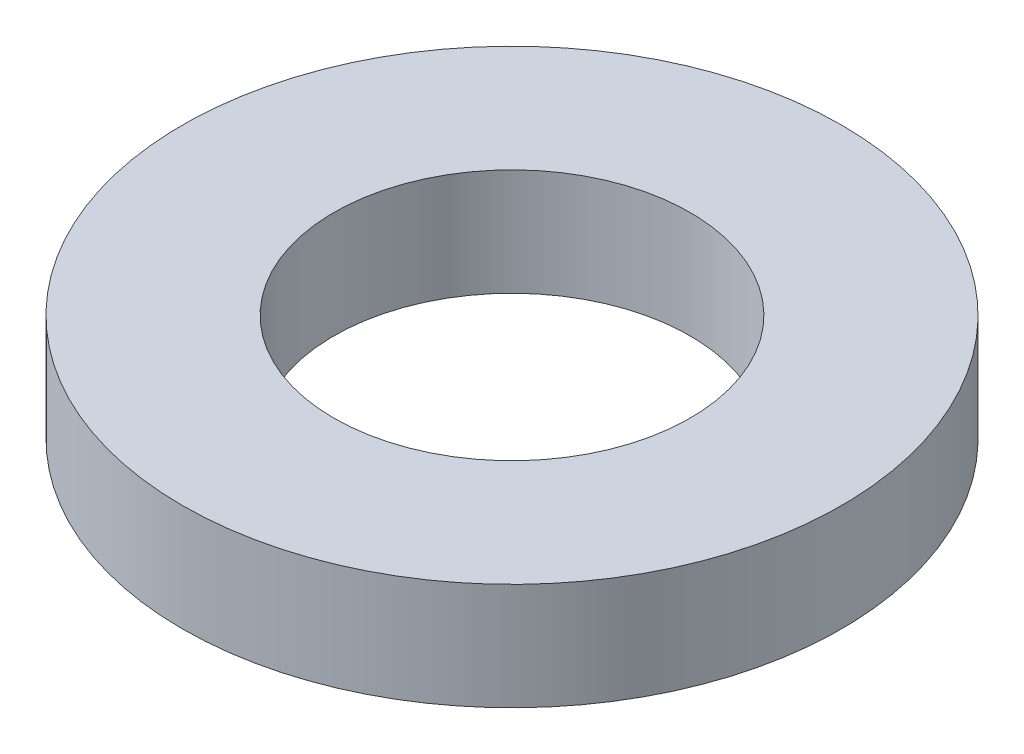
ISO-10303-21;
HEADER;
FILE_DESCRIPTION(('STEP AP214'),'2;1');
FILE_NAME('part.step','',(''),(''),'','','');
FILE_SCHEMA(('AUTOMOTIVE_DESIGN { 1 0 10303 214 1 1 1 1 }'));
ENDSEC;
DATA;
#1=APPLICATION_CONTEXT('core data for automotive mechanical design processes');
#2=APPLICATION_PROTOCOL_DEFINITION('international standard','automotive_design',2000,#1);
#3=PRODUCT_CONTEXT('',#1,'mechanical');
#4=PRODUCT('Part','Part','',(#3));
#5=PRODUCT_RELATED_PRODUCT_CATEGORY('part','',(#4));
#6=PRODUCT_DEFINITION_FORMATION('','',#4);
#7=PRODUCT_DEFINITION_CONTEXT('part definition',#1,'design');
#8=PRODUCT_DEFINITION('design','',#6,#7);
#9=PRODUCT_DEFINITION_SHAPE('','',#8);
#10=(LENGTH_UNIT() NAMED_UNIT(*) SI_UNIT(.MILLI.,.METRE.));
#11=(NAMED_UNIT(*) PLANE_ANGLE_UNIT() SI_UNIT($,.RADIAN.));
#12=(NAMED_UNIT(*) SI_UNIT($,.STERADIAN.) SOLID_ANGLE_UNIT());
#13=UNCERTAINTY_MEASURE_WITH_UNIT(LENGTH_MEASURE(1.E-05),#10,'distance_accuracy_value','');
#14=(GEOMETRIC_REPRESENTATION_CONTEXT(3) GLOBAL_UNCERTAINTY_ASSIGNED_CONTEXT((#13)) GLOBAL_UNIT_ASSIGNED_CONTEXT((#10,
#11,#12)) REPRESENTATION_CONTEXT('',''));
#15=CARTESIAN_POINT('',(0.,0.,0.));
#16=DIRECTION('',(0.,0.,1.));
#17=DIRECTION('',(1.,0.,0.));
#18=AXIS2_PLACEMENT_3D('',#15,#16,#17);
#19=CARTESIAN_POINT('',(0.,30.,0.));
#20=DIRECTION('',(0.,-1.,0.));
#21=DIRECTION('',(0.,0.,-1.));
#22=AXIS2_PLACEMENT_3D('',#19,#20,#21);
#23=CYLINDRICAL_SURFACE('',#22,92.5);
#24=CARTESIAN_POINT('',(0.,30.,0.));
#25=DIRECTION('',(0.,1.,0.));
#26=DIRECTION('',(0.,0.,1.));
#27=AXIS2_PLACEMENT_3D('',#24,#25,#26);
#28=CIRCLE('',#27,92.5);
#29=CARTESIAN_POINT('',(0.,30.,92.5));
#30=VERTEX_POINT('',#29);
#31=EDGE_CURVE('E10',#30,#30,#28,.T.);
#32=ORIENTED_EDGE('',*,*,#31,.F.);
#33=EDGE_LOOP('',(#32));
#34=FACE_BOUND('',#33,.T.);
#35=CARTESIAN_POINT('',(0.,0.,0.));
#36=DIRECTION('',(0.,1.,0.));
#37=DIRECTION('',(0.,0.,1.));
#38=AXIS2_PLACEMENT_3D('',#35,#36,#37);
#39=CIRCLE('',#38,92.5);
#40=CARTESIAN_POINT('',(0.,0.,92.5));
#41=VERTEX_POINT('',#40);
#42=EDGE_CURVE('E37',#41,#41,#39,.T.);
#43=ORIENTED_EDGE('',*,*,#42,.T.);
#44=EDGE_LOOP('',(#43));
#45=FACE_BOUND('',#44,.T.);
#46=ADVANCED_FACE('F40',(#34,#45),#23,.T.);
#47=CARTESIAN_POINT('',(0.,30.,0.));
#48=DIRECTION('',(0.,1.,0.));
#49=DIRECTION('',(0.,0.,1.));
#50=AXIS2_PLACEMENT_3D('',#47,#48,#49);
#51=PLANE('',#50);
#52=CARTESIAN_POINT('',(0.,30.,0.));
#53=DIRECTION('',(0.,1.,0.));
#54=DIRECTION('',(0.,0.,1.));
#55=AXIS2_PLACEMENT_3D('',#52,#53,#54);
#56=CIRCLE('',#55,50.);
#57=CARTESIAN_POINT('',(0.,30.,50.));
#58=VERTEX_POINT('',#57);
#59=EDGE_CURVE('E50',#58,#58,#56,.T.);
#60=ORIENTED_EDGE('',*,*,#59,.F.);
#61=EDGE_LOOP('',(#60));
#62=FACE_BOUND('',#61,.T.);
#63=ORIENTED_EDGE('',*,*,#31,.T.);
#64=EDGE_LOOP('',(#63));
#65=FACE_BOUND('',#64,.T.);
#66=ADVANCED_FACE('F59',(#62,#65),#51,.T.);
#67=CARTESIAN_POINT('',(0.,0.,0.));
#68=DIRECTION('',(0.,1.,0.));
#69=DIRECTION('',(0.,0.,1.));
#70=AXIS2_PLACEMENT_3D('',#67,#68,#69);
#71=PLANE('',#70);
#72=CARTESIAN_POINT('',(0.,0.,0.));
#73=DIRECTION('',(0.,1.,0.));
#74=DIRECTION('',(0.,0.,1.));
#75=AXIS2_PLACEMENT_3D('',#72,#73,#74);
#76=CIRCLE('',#75,50.);
#77=CARTESIAN_POINT('',(0.,0.,50.));
#78=VERTEX_POINT('',#77);
#79=EDGE_CURVE('E47',#78,#78,#76,.T.);
#80=ORIENTED_EDGE('',*,*,#79,.T.);
#81=EDGE_LOOP('',(#80));
#82=FACE_BOUND('',#81,.T.);
#83=ORIENTED_EDGE('',*,*,#42,.F.);
#84=EDGE_LOOP('',(#83));
#85=FACE_BOUND('',#84,.T.);
#86=ADVANCED_FACE('F58',(#82,#85),#71,.F.);
#87=CARTESIAN_POINT('',(0.,30.,0.));
#88=DIRECTION('',(0.,-1.,0.));
#89=DIRECTION('',(0.,0.,-1.));
#90=AXIS2_PLACEMENT_3D('',#87,#88,#89);
#91=CYLINDRICAL_SURFACE('',#90,50.);
#92=ORIENTED_EDGE('',*,*,#59,.T.);
#93=EDGE_LOOP('',(#92));
#94=FACE_BOUND('',#93,.T.);
#95=ORIENTED_EDGE('',*,*,#79,.F.);
#96=EDGE_LOOP('',(#95));
#97=FACE_BOUND('',#96,.T.);
#98=ADVANCED_FACE('F54',(#94,#97),#91,.F.);
#99=CLOSED_SHELL('',(#46,#66,#86,#98));
#100=MANIFOLD_SOLID_BREP('B2',#99);
#101=ADVANCED_BREP_SHAPE_REPRESENTATION('',(#18,#100),#14);
#102=SHAPE_DEFINITION_REPRESENTATION(#9,#101);
ENDSEC;
END-ISO-10303-21;
